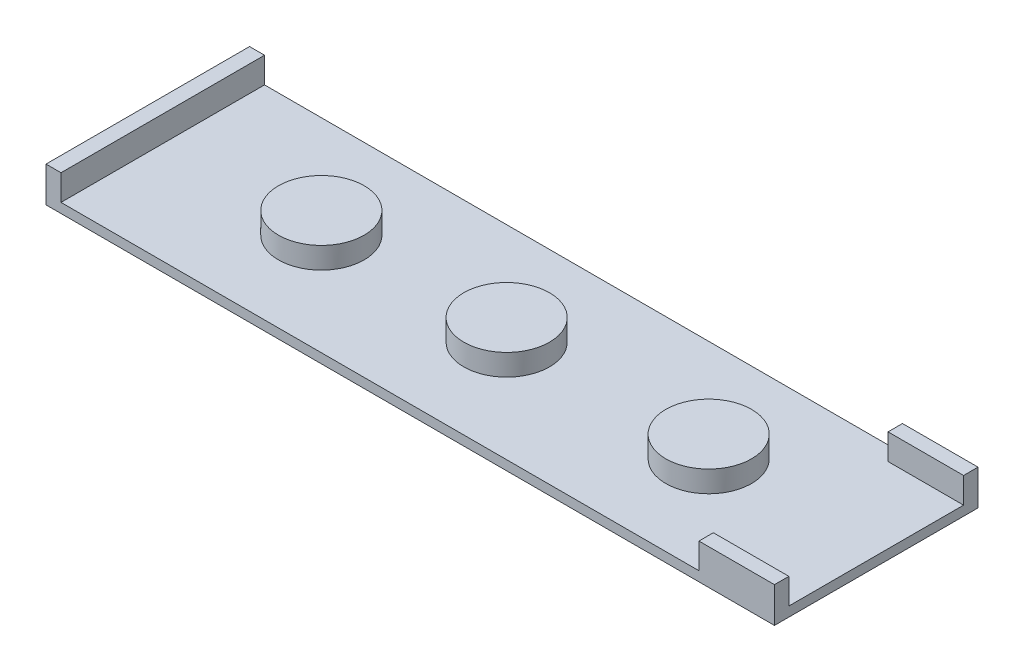
ISO-10303-21;
HEADER;
FILE_DESCRIPTION(('STEP AP214'),'2;1');
FILE_NAME('part.step','',(''),(''),'','','');
FILE_SCHEMA(('AUTOMOTIVE_DESIGN { 1 0 10303 214 1 1 1 1 }'));
ENDSEC;
DATA;
#1=APPLICATION_CONTEXT('core data for automotive mechanical design processes');
#2=APPLICATION_PROTOCOL_DEFINITION('international standard','automotive_design',2000,#1);
#3=PRODUCT_CONTEXT('',#1,'mechanical');
#4=PRODUCT('Part','Part','',(#3));
#5=PRODUCT_RELATED_PRODUCT_CATEGORY('part','',(#4));
#6=PRODUCT_DEFINITION_FORMATION('','',#4);
#7=PRODUCT_DEFINITION_CONTEXT('part definition',#1,'design');
#8=PRODUCT_DEFINITION('design','',#6,#7);
#9=PRODUCT_DEFINITION_SHAPE('','',#8);
#10=(LENGTH_UNIT() NAMED_UNIT(*) SI_UNIT(.MILLI.,.METRE.));
#11=(NAMED_UNIT(*) PLANE_ANGLE_UNIT() SI_UNIT($,.RADIAN.));
#12=(NAMED_UNIT(*) SI_UNIT($,.STERADIAN.) SOLID_ANGLE_UNIT());
#13=UNCERTAINTY_MEASURE_WITH_UNIT(LENGTH_MEASURE(1.E-05),#10,'distance_accuracy_value','');
#14=(GEOMETRIC_REPRESENTATION_CONTEXT(3) GLOBAL_UNCERTAINTY_ASSIGNED_CONTEXT((#13)) GLOBAL_UNIT_ASSIGNED_CONTEXT((#10,
#11,#12)) REPRESENTATION_CONTEXT('',''));
#15=CARTESIAN_POINT('',(0.,0.,0.));
#16=DIRECTION('',(0.,0.,1.));
#17=DIRECTION('',(1.,0.,0.));
#18=AXIS2_PLACEMENT_3D('',#15,#16,#17);
#19=CARTESIAN_POINT('',(0.,0.45,0.));
#20=DIRECTION('',(0.,-1.,0.));
#21=DIRECTION('',(0.,0.,-1.));
#22=AXIS2_PLACEMENT_3D('',#19,#20,#21);
#23=PLANE('',#22);
#24=CARTESIAN_POINT('',(14.3230348258706,0.45,1.01616915422886));
#25=DIRECTION('',(0.,-1.,0.));
#26=DIRECTION('',(0.,0.,-1.));
#27=AXIS2_PLACEMENT_3D('',#24,#25,#26);
#28=CIRCLE('',#27,2.);
#29=CARTESIAN_POINT('',(14.3230348258706,0.45,-0.983830845771148));
#30=VERTEX_POINT('',#29);
#31=EDGE_CURVE('E11',#30,#30,#28,.F.);
#32=ORIENTED_EDGE('',*,*,#31,.F.);
#33=EDGE_LOOP('',(#32));
#34=FACE_BOUND('',#33,.T.);
#35=CARTESIAN_POINT('',(4.89303482587064,0.45,1.01616915422886));
#36=DIRECTION('',(0.,-1.,0.));
#37=DIRECTION('',(0.,0.,-1.));
#38=AXIS2_PLACEMENT_3D('',#35,#36,#37);
#39=CIRCLE('',#38,2.);
#40=CARTESIAN_POINT('',(4.89303482587064,0.45,-0.983830845771145));
#41=VERTEX_POINT('',#40);
#42=EDGE_CURVE('E41',#41,#41,#39,.F.);
#43=ORIENTED_EDGE('',*,*,#42,.F.);
#44=EDGE_LOOP('',(#43));
#45=FACE_BOUND('',#44,.T.);
#46=CARTESIAN_POINT('',(-3.75696517412936,0.45,1.01616915422886));
#47=DIRECTION('',(0.,-1.,0.));
#48=DIRECTION('',(0.,0.,-1.));
#49=AXIS2_PLACEMENT_3D('',#46,#47,#48);
#50=CIRCLE('',#49,2.);
#51=CARTESIAN_POINT('',(-3.75696517412936,0.45,-0.983830845771145));
#52=VERTEX_POINT('',#51);
#53=EDGE_CURVE('E224',#52,#52,#50,.F.);
#54=ORIENTED_EDGE('',*,*,#53,.F.);
#55=EDGE_LOOP('',(#54));
#56=FACE_BOUND('',#55,.T.);
#57=DIRECTION('',(-1.,0.,0.));
#58=VECTOR('',#57,1.);
#59=CARTESIAN_POINT('',(22.1430348258706,0.45,5.09400851308146));
#60=LINE('',#59,#58);
#61=CARTESIAN_POINT('',(22.1430348258706,0.45,5.09400851308146));
#62=VERTEX_POINT('',#61);
#63=CARTESIAN_POINT('',(18.6182099532586,0.45,5.09400851308146));
#64=VERTEX_POINT('',#63);
#65=EDGE_CURVE('E236',#62,#64,#60,.T.);
#66=ORIENTED_EDGE('',*,*,#65,.F.);
#67=DIRECTION('',(0.,0.,-1.));
#68=VECTOR('',#67,1.);
#69=CARTESIAN_POINT('',(22.1430348258706,0.45,5.76616915422885));
#70=LINE('',#69,#68);
#71=CARTESIAN_POINT('',(22.1430348258706,0.45,-3.06038631168173));
#72=VERTEX_POINT('',#71);
#73=EDGE_CURVE('E143',#62,#72,#70,.T.);
#74=ORIENTED_EDGE('',*,*,#73,.T.);
#75=DIRECTION('',(1.,0.,0.));
#76=VECTOR('',#75,1.);
#77=CARTESIAN_POINT('',(22.1430348258706,0.45,-3.06038631168173));
#78=LINE('',#77,#76);
#79=CARTESIAN_POINT('',(18.6182099532586,0.45,-3.06038631168173));
#80=VERTEX_POINT('',#79);
#81=EDGE_CURVE('E147',#80,#72,#78,.T.);
#82=ORIENTED_EDGE('',*,*,#81,.F.);
#83=DIRECTION('',(0.,0.,1.));
#84=VECTOR('',#83,1.);
#85=CARTESIAN_POINT('',(18.6182099532586,0.45,-3.73383084577114));
#86=LINE('',#85,#84);
#87=CARTESIAN_POINT('',(18.6182099532586,0.45,-3.73383084577114));
#88=VERTEX_POINT('',#87);
#89=EDGE_CURVE('E144',#88,#80,#86,.T.);
#90=ORIENTED_EDGE('',*,*,#89,.F.);
#91=DIRECTION('',(-1.,0.,0.));
#92=VECTOR('',#91,1.);
#93=CARTESIAN_POINT('',(-11.8569651741294,0.45,-3.73383084577114));
#94=LINE('',#93,#92);
#95=CARTESIAN_POINT('',(-11.1569651741294,0.45,-3.73383084577114));
#96=VERTEX_POINT('',#95);
#97=EDGE_CURVE('E204',#88,#96,#94,.T.);
#98=ORIENTED_EDGE('',*,*,#97,.T.);
#99=DIRECTION('',(0.,0.,-1.));
#100=VECTOR('',#99,1.);
#101=CARTESIAN_POINT('',(-11.1569651741294,0.45,-3.73383084577114));
#102=LINE('',#101,#100);
#103=CARTESIAN_POINT('',(-11.1569651741294,0.45,5.76616915422886));
#104=VERTEX_POINT('',#103);
#105=EDGE_CURVE('E181',#104,#96,#102,.T.);
#106=ORIENTED_EDGE('',*,*,#105,.F.);
#107=DIRECTION('',(1.,0.,0.));
#108=VECTOR('',#107,1.);
#109=CARTESIAN_POINT('',(-11.8569651741294,0.45,5.76616915422886));
#110=LINE('',#109,#108);
#111=CARTESIAN_POINT('',(18.6182099532586,0.45,5.76616915422885));
#112=VERTEX_POINT('',#111);
#113=EDGE_CURVE('E53',#104,#112,#110,.T.);
#114=ORIENTED_EDGE('',*,*,#113,.T.);
#115=DIRECTION('',(0.,0.,1.));
#116=VECTOR('',#115,1.);
#117=CARTESIAN_POINT('',(18.6182099532586,0.45,5.76616915422885));
#118=LINE('',#117,#116);
#119=EDGE_CURVE('E48',#64,#112,#118,.T.);
#120=ORIENTED_EDGE('',*,*,#119,.F.);
#121=EDGE_LOOP('',(#66,#74,#82,#90,#98,#106,#114,#120));
#122=FACE_BOUND('',#121,.T.);
#123=ADVANCED_FACE('F33',(#34,#45,#56,#122),#23,.F.);
#124=CARTESIAN_POINT('',(-11.8569651741294,0.45,5.76616915422886));
#125=DIRECTION('',(1.,0.,0.));
#126=DIRECTION('',(0.,0.,-1.));
#127=AXIS2_PLACEMENT_3D('',#124,#125,#126);
#128=PLANE('',#127);
#129=DIRECTION('',(0.,0.,1.));
#130=VECTOR('',#129,1.);
#131=CARTESIAN_POINT('',(-11.8569651741294,0.,5.76616915422886));
#132=LINE('',#131,#130);
#133=CARTESIAN_POINT('',(-11.8569651741294,0.,-3.73383084577114));
#134=VERTEX_POINT('',#133);
#135=CARTESIAN_POINT('',(-11.8569651741294,0.,5.76616915422886));
#136=VERTEX_POINT('',#135);
#137=EDGE_CURVE('E200',#134,#136,#132,.T.);
#138=ORIENTED_EDGE('',*,*,#137,.T.);
#139=DIRECTION('',(0.,-1.,0.));
#140=VECTOR('',#139,1.);
#141=CARTESIAN_POINT('',(-11.8569651741294,0.45,5.76616915422886));
#142=LINE('',#141,#140);
#143=CARTESIAN_POINT('',(-11.8569651741294,1.65,5.76616915422886));
#144=VERTEX_POINT('',#143);
#145=EDGE_CURVE('E221',#144,#136,#142,.T.);
#146=ORIENTED_EDGE('',*,*,#145,.F.);
#147=DIRECTION('',(0.,0.,1.));
#148=VECTOR('',#147,1.);
#149=CARTESIAN_POINT('',(-11.8569651741294,1.65,-3.73383084577114));
#150=LINE('',#149,#148);
#151=CARTESIAN_POINT('',(-11.8569651741294,1.65,-3.73383084577114));
#152=VERTEX_POINT('',#151);
#153=EDGE_CURVE('E182',#152,#144,#150,.T.);
#154=ORIENTED_EDGE('',*,*,#153,.F.);
#155=DIRECTION('',(0.,-1.,0.));
#156=VECTOR('',#155,1.);
#157=CARTESIAN_POINT('',(-11.8569651741294,0.45,-3.73383084577114));
#158=LINE('',#157,#156);
#159=EDGE_CURVE('E206',#152,#134,#158,.T.);
#160=ORIENTED_EDGE('',*,*,#159,.T.);
#161=EDGE_LOOP('',(#138,#146,#154,#160));
#162=FACE_BOUND('',#161,.T.);
#163=ADVANCED_FACE('F35',(#162),#128,.F.);
#164=CARTESIAN_POINT('',(-11.8569651741294,0.45,5.76616915422886));
#165=DIRECTION('',(0.,0.,-1.));
#166=DIRECTION('',(-1.,0.,0.));
#167=AXIS2_PLACEMENT_3D('',#164,#165,#166);
#168=PLANE('',#167);
#169=DIRECTION('',(1.,0.,0.));
#170=VECTOR('',#169,1.);
#171=CARTESIAN_POINT('',(-11.8569651741294,0.,5.76616915422886));
#172=LINE('',#171,#170);
#173=CARTESIAN_POINT('',(22.1430348258706,0.,5.76616915422885));
#174=VERTEX_POINT('',#173);
#175=EDGE_CURVE('E209',#136,#174,#172,.T.);
#176=ORIENTED_EDGE('',*,*,#175,.T.);
#177=DIRECTION('',(0.,-1.,0.));
#178=VECTOR('',#177,1.);
#179=CARTESIAN_POINT('',(22.1430348258706,0.45,5.76616915422885));
#180=LINE('',#179,#178);
#181=CARTESIAN_POINT('',(22.1430348258706,1.65,5.76616915422885));
#182=VERTEX_POINT('',#181);
#183=EDGE_CURVE('E219',#182,#174,#180,.T.);
#184=ORIENTED_EDGE('',*,*,#183,.F.);
#185=DIRECTION('',(1.,0.,0.));
#186=VECTOR('',#185,1.);
#187=CARTESIAN_POINT('',(22.1430348258706,1.65,5.76616915422885));
#188=LINE('',#187,#186);
#189=CARTESIAN_POINT('',(18.6182099532586,1.65,5.76616915422885));
#190=VERTEX_POINT('',#189);
#191=EDGE_CURVE('E137',#190,#182,#188,.T.);
#192=ORIENTED_EDGE('',*,*,#191,.F.);
#193=DIRECTION('',(0.,-1.,0.));
#194=VECTOR('',#193,1.);
#195=CARTESIAN_POINT('',(18.6182099532586,1.65,5.76616915422885));
#196=LINE('',#195,#194);
#197=EDGE_CURVE('E149',#190,#112,#196,.T.);
#198=ORIENTED_EDGE('',*,*,#197,.T.);
#199=ORIENTED_EDGE('',*,*,#113,.F.);
#200=DIRECTION('',(0.,-1.,0.));
#201=VECTOR('',#200,1.);
#202=CARTESIAN_POINT('',(-11.1569651741294,1.65,5.76616915422886));
#203=LINE('',#202,#201);
#204=CARTESIAN_POINT('',(-11.1569651741294,1.65,5.76616915422886));
#205=VERTEX_POINT('',#204);
#206=EDGE_CURVE('E197',#205,#104,#203,.T.);
#207=ORIENTED_EDGE('',*,*,#206,.F.);
#208=DIRECTION('',(1.,0.,0.));
#209=VECTOR('',#208,1.);
#210=CARTESIAN_POINT('',(-11.8569651741294,1.65,5.76616915422886));
#211=LINE('',#210,#209);
#212=EDGE_CURVE('E185',#144,#205,#211,.T.);
#213=ORIENTED_EDGE('',*,*,#212,.F.);
#214=ORIENTED_EDGE('',*,*,#145,.T.);
#215=EDGE_LOOP('',(#176,#184,#192,#198,#199,#207,#213,#214));
#216=FACE_BOUND('',#215,.T.);
#217=ADVANCED_FACE('F246',(#216),#168,.F.);
#218=CARTESIAN_POINT('',(22.1430348258706,0.45,5.76616915422885));
#219=DIRECTION('',(-1.,0.,0.));
#220=DIRECTION('',(0.,0.,1.));
#221=AXIS2_PLACEMENT_3D('',#218,#219,#220);
#222=PLANE('',#221);
#223=DIRECTION('',(0.,0.,-1.));
#224=VECTOR('',#223,1.);
#225=CARTESIAN_POINT('',(22.1430348258706,0.,5.76616915422885));
#226=LINE('',#225,#224);
#227=CARTESIAN_POINT('',(22.1430348258706,0.,-3.73383084577114));
#228=VERTEX_POINT('',#227);
#229=EDGE_CURVE('E211',#174,#228,#226,.T.);
#230=ORIENTED_EDGE('',*,*,#229,.T.);
#231=DIRECTION('',(0.,-1.,0.));
#232=VECTOR('',#231,1.);
#233=CARTESIAN_POINT('',(22.1430348258706,0.45,-3.73383084577114));
#234=LINE('',#233,#232);
#235=CARTESIAN_POINT('',(22.1430348258706,1.65,-3.73383084577114));
#236=VERTEX_POINT('',#235);
#237=EDGE_CURVE('E216',#236,#228,#234,.T.);
#238=ORIENTED_EDGE('',*,*,#237,.F.);
#239=DIRECTION('',(0.,0.,-1.));
#240=VECTOR('',#239,1.);
#241=CARTESIAN_POINT('',(22.1430348258706,1.65,-3.73383084577114));
#242=LINE('',#241,#240);
#243=CARTESIAN_POINT('',(22.1430348258706,1.65,-3.06038631168173));
#244=VERTEX_POINT('',#243);
#245=EDGE_CURVE('E153',#244,#236,#242,.T.);
#246=ORIENTED_EDGE('',*,*,#245,.F.);
#247=DIRECTION('',(0.,-1.,0.));
#248=VECTOR('',#247,1.);
#249=CARTESIAN_POINT('',(22.1430348258706,1.65,-3.06038631168173));
#250=LINE('',#249,#248);
#251=EDGE_CURVE('E161',#244,#72,#250,.T.);
#252=ORIENTED_EDGE('',*,*,#251,.T.);
#253=ORIENTED_EDGE('',*,*,#73,.F.);
#254=DIRECTION('',(0.,-1.,0.));
#255=VECTOR('',#254,1.);
#256=CARTESIAN_POINT('',(22.1430348258706,1.65,5.09400851308146));
#257=LINE('',#256,#255);
#258=CARTESIAN_POINT('',(22.1430348258706,1.65,5.09400851308146));
#259=VERTEX_POINT('',#258);
#260=EDGE_CURVE('E125',#259,#62,#257,.T.);
#261=ORIENTED_EDGE('',*,*,#260,.F.);
#262=DIRECTION('',(0.,0.,-1.));
#263=VECTOR('',#262,1.);
#264=CARTESIAN_POINT('',(22.1430348258706,1.65,5.76616915422885));
#265=LINE('',#264,#263);
#266=EDGE_CURVE('E131',#182,#259,#265,.T.);
#267=ORIENTED_EDGE('',*,*,#266,.F.);
#268=ORIENTED_EDGE('',*,*,#183,.T.);
#269=EDGE_LOOP('',(#230,#238,#246,#252,#253,#261,#267,#268));
#270=FACE_BOUND('',#269,.T.);
#271=ADVANCED_FACE('F141',(#270),#222,.F.);
#272=CARTESIAN_POINT('',(-11.8569651741294,0.45,-3.73383084577114));
#273=DIRECTION('',(0.,0.,1.));
#274=DIRECTION('',(1.,0.,0.));
#275=AXIS2_PLACEMENT_3D('',#272,#273,#274);
#276=PLANE('',#275);
#277=DIRECTION('',(-1.,0.,0.));
#278=VECTOR('',#277,1.);
#279=CARTESIAN_POINT('',(-11.8569651741294,0.,-3.73383084577114));
#280=LINE('',#279,#278);
#281=EDGE_CURVE('E202',#228,#134,#280,.T.);
#282=ORIENTED_EDGE('',*,*,#281,.T.);
#283=ORIENTED_EDGE('',*,*,#159,.F.);
#284=DIRECTION('',(-1.,0.,0.));
#285=VECTOR('',#284,1.);
#286=CARTESIAN_POINT('',(-11.8569651741294,1.65,-3.73383084577114));
#287=LINE('',#286,#285);
#288=CARTESIAN_POINT('',(-11.1569651741294,1.65,-3.73383084577114));
#289=VERTEX_POINT('',#288);
#290=EDGE_CURVE('E189',#289,#152,#287,.T.);
#291=ORIENTED_EDGE('',*,*,#290,.F.);
#292=DIRECTION('',(0.,-1.,0.));
#293=VECTOR('',#292,1.);
#294=CARTESIAN_POINT('',(-11.1569651741294,1.65,-3.73383084577114));
#295=LINE('',#294,#293);
#296=EDGE_CURVE('E192',#289,#96,#295,.T.);
#297=ORIENTED_EDGE('',*,*,#296,.T.);
#298=ORIENTED_EDGE('',*,*,#97,.F.);
#299=DIRECTION('',(0.,-1.,0.));
#300=VECTOR('',#299,1.);
#301=CARTESIAN_POINT('',(18.6182099532586,1.65,-3.73383084577114));
#302=LINE('',#301,#300);
#303=CARTESIAN_POINT('',(18.6182099532586,1.65,-3.73383084577114));
#304=VERTEX_POINT('',#303);
#305=EDGE_CURVE('E169',#304,#88,#302,.T.);
#306=ORIENTED_EDGE('',*,*,#305,.F.);
#307=DIRECTION('',(-1.,0.,0.));
#308=VECTOR('',#307,1.);
#309=CARTESIAN_POINT('',(22.1430348258706,1.65,-3.73383084577114));
#310=LINE('',#309,#308);
#311=EDGE_CURVE('E156',#236,#304,#310,.T.);
#312=ORIENTED_EDGE('',*,*,#311,.F.);
#313=ORIENTED_EDGE('',*,*,#237,.T.);
#314=EDGE_LOOP('',(#282,#283,#291,#297,#298,#306,#312,#313));
#315=FACE_BOUND('',#314,.T.);
#316=ADVANCED_FACE('F253',(#315),#276,.F.);
#317=CARTESIAN_POINT('',(0.,0.,0.));
#318=DIRECTION('',(0.,-1.,0.));
#319=DIRECTION('',(0.,0.,-1.));
#320=AXIS2_PLACEMENT_3D('',#317,#318,#319);
#321=PLANE('',#320);
#322=ORIENTED_EDGE('',*,*,#137,.F.);
#323=ORIENTED_EDGE('',*,*,#281,.F.);
#324=ORIENTED_EDGE('',*,*,#229,.F.);
#325=ORIENTED_EDGE('',*,*,#175,.F.);
#326=EDGE_LOOP('',(#322,#323,#324,#325));
#327=FACE_BOUND('',#326,.T.);
#328=ADVANCED_FACE('F251',(#327),#321,.T.);
#329=CARTESIAN_POINT('',(-11.1569651741294,1.65,-3.73383084577114));
#330=DIRECTION('',(-1.,0.,0.));
#331=DIRECTION('',(0.,0.,1.));
#332=AXIS2_PLACEMENT_3D('',#329,#330,#331);
#333=PLANE('',#332);
#334=ORIENTED_EDGE('',*,*,#105,.T.);
#335=ORIENTED_EDGE('',*,*,#296,.F.);
#336=DIRECTION('',(0.,0.,-1.));
#337=VECTOR('',#336,1.);
#338=CARTESIAN_POINT('',(-11.1569651741294,1.65,-3.73383084577114));
#339=LINE('',#338,#337);
#340=EDGE_CURVE('E187',#205,#289,#339,.T.);
#341=ORIENTED_EDGE('',*,*,#340,.F.);
#342=ORIENTED_EDGE('',*,*,#206,.T.);
#343=EDGE_LOOP('',(#334,#335,#341,#342));
#344=FACE_BOUND('',#343,.T.);
#345=ADVANCED_FACE('F267',(#344),#333,.F.);
#346=CARTESIAN_POINT('',(0.,1.65,0.));
#347=DIRECTION('',(0.,1.,0.));
#348=DIRECTION('',(0.,0.,1.));
#349=AXIS2_PLACEMENT_3D('',#346,#347,#348);
#350=PLANE('',#349);
#351=ORIENTED_EDGE('',*,*,#153,.T.);
#352=ORIENTED_EDGE('',*,*,#212,.T.);
#353=ORIENTED_EDGE('',*,*,#340,.T.);
#354=ORIENTED_EDGE('',*,*,#290,.T.);
#355=EDGE_LOOP('',(#351,#352,#353,#354));
#356=FACE_BOUND('',#355,.T.);
#357=ADVANCED_FACE('F260',(#356),#350,.T.);
#358=CARTESIAN_POINT('',(-3.75696517412936,1.45,1.01616915422886));
#359=DIRECTION('',(0.,-1.,0.));
#360=DIRECTION('',(0.,0.,-1.));
#361=AXIS2_PLACEMENT_3D('',#358,#359,#360);
#362=CYLINDRICAL_SURFACE('',#361,2.);
#363=CARTESIAN_POINT('',(-3.75696517412936,1.45,1.01616915422886));
#364=DIRECTION('',(0.,1.,0.));
#365=DIRECTION('',(0.,0.,1.));
#366=AXIS2_PLACEMENT_3D('',#363,#364,#365);
#367=CIRCLE('',#366,2.);
#368=CARTESIAN_POINT('',(-3.75696517412936,1.45,3.01616915422886));
#369=VERTEX_POINT('',#368);
#370=EDGE_CURVE('E178',#369,#369,#367,.T.);
#371=ORIENTED_EDGE('',*,*,#370,.F.);
#372=EDGE_LOOP('',(#371));
#373=FACE_BOUND('',#372,.T.);
#374=ORIENTED_EDGE('',*,*,#53,.T.);
#375=EDGE_LOOP('',(#374));
#376=FACE_BOUND('',#375,.T.);
#377=ADVANCED_FACE('F307',(#373,#376),#362,.T.);
#378=CARTESIAN_POINT('',(-3.75696517412936,1.45,1.01616915422886));
#379=DIRECTION('',(0.,1.,0.));
#380=DIRECTION('',(0.,0.,1.));
#381=AXIS2_PLACEMENT_3D('',#378,#379,#380);
#382=PLANE('',#381);
#383=ORIENTED_EDGE('',*,*,#370,.T.);
#384=EDGE_LOOP('',(#383));
#385=FACE_BOUND('',#384,.T.);
#386=ADVANCED_FACE('F303',(#385),#382,.T.);
#387=CARTESIAN_POINT('',(4.89303482587064,1.45,1.01616915422886));
#388=DIRECTION('',(0.,-1.,0.));
#389=DIRECTION('',(0.,0.,-1.));
#390=AXIS2_PLACEMENT_3D('',#387,#388,#389);
#391=CYLINDRICAL_SURFACE('',#390,2.);
#392=CARTESIAN_POINT('',(4.89303482587064,1.45,1.01616915422886));
#393=DIRECTION('',(0.,1.,0.));
#394=DIRECTION('',(0.,0.,1.));
#395=AXIS2_PLACEMENT_3D('',#392,#393,#394);
#396=CIRCLE('',#395,2.);
#397=CARTESIAN_POINT('',(4.89303482587064,1.45,3.01616915422886));
#398=VERTEX_POINT('',#397);
#399=EDGE_CURVE('E175',#398,#398,#396,.T.);
#400=ORIENTED_EDGE('',*,*,#399,.F.);
#401=EDGE_LOOP('',(#400));
#402=FACE_BOUND('',#401,.T.);
#403=ORIENTED_EDGE('',*,*,#42,.T.);
#404=EDGE_LOOP('',(#403));
#405=FACE_BOUND('',#404,.T.);
#406=ADVANCED_FACE('F229',(#402,#405),#391,.T.);
#407=CARTESIAN_POINT('',(4.89303482587064,1.45,1.01616915422886));
#408=DIRECTION('',(0.,1.,0.));
#409=DIRECTION('',(0.,0.,1.));
#410=AXIS2_PLACEMENT_3D('',#407,#408,#409);
#411=PLANE('',#410);
#412=ORIENTED_EDGE('',*,*,#399,.T.);
#413=EDGE_LOOP('',(#412));
#414=FACE_BOUND('',#413,.T.);
#415=ADVANCED_FACE('F296',(#414),#411,.T.);
#416=CARTESIAN_POINT('',(14.3230348258706,1.45,1.01616915422886));
#417=DIRECTION('',(0.,-1.,0.));
#418=DIRECTION('',(0.,0.,-1.));
#419=AXIS2_PLACEMENT_3D('',#416,#417,#418);
#420=CYLINDRICAL_SURFACE('',#419,2.);
#421=CARTESIAN_POINT('',(14.3230348258706,1.45,1.01616915422886));
#422=DIRECTION('',(0.,1.,0.));
#423=DIRECTION('',(0.,0.,1.));
#424=AXIS2_PLACEMENT_3D('',#421,#422,#423);
#425=CIRCLE('',#424,2.);
#426=CARTESIAN_POINT('',(14.3230348258706,1.45,3.01616915422886));
#427=VERTEX_POINT('',#426);
#428=EDGE_CURVE('E172',#427,#427,#425,.T.);
#429=ORIENTED_EDGE('',*,*,#428,.F.);
#430=EDGE_LOOP('',(#429));
#431=FACE_BOUND('',#430,.T.);
#432=ORIENTED_EDGE('',*,*,#31,.T.);
#433=EDGE_LOOP('',(#432));
#434=FACE_BOUND('',#433,.T.);
#435=ADVANCED_FACE('F292',(#431,#434),#420,.T.);
#436=CARTESIAN_POINT('',(14.3230348258706,1.45,1.01616915422886));
#437=DIRECTION('',(0.,1.,0.));
#438=DIRECTION('',(0.,0.,1.));
#439=AXIS2_PLACEMENT_3D('',#436,#437,#438);
#440=PLANE('',#439);
#441=ORIENTED_EDGE('',*,*,#428,.T.);
#442=EDGE_LOOP('',(#441));
#443=FACE_BOUND('',#442,.T.);
#444=ADVANCED_FACE('F286',(#443),#440,.T.);
#445=CARTESIAN_POINT('',(18.6182099532586,1.65,-3.73383084577114));
#446=DIRECTION('',(1.,0.,0.));
#447=DIRECTION('',(0.,0.,-1.));
#448=AXIS2_PLACEMENT_3D('',#445,#446,#447);
#449=PLANE('',#448);
#450=ORIENTED_EDGE('',*,*,#89,.T.);
#451=DIRECTION('',(0.,-1.,0.));
#452=VECTOR('',#451,1.);
#453=CARTESIAN_POINT('',(18.6182099532586,1.65,-3.06038631168173));
#454=LINE('',#453,#452);
#455=CARTESIAN_POINT('',(18.6182099532586,1.65,-3.06038631168173));
#456=VERTEX_POINT('',#455);
#457=EDGE_CURVE('E166',#456,#80,#454,.T.);
#458=ORIENTED_EDGE('',*,*,#457,.F.);
#459=DIRECTION('',(0.,0.,1.));
#460=VECTOR('',#459,1.);
#461=CARTESIAN_POINT('',(18.6182099532586,1.65,-3.73383084577114));
#462=LINE('',#461,#460);
#463=EDGE_CURVE('E158',#304,#456,#462,.T.);
#464=ORIENTED_EDGE('',*,*,#463,.F.);
#465=ORIENTED_EDGE('',*,*,#305,.T.);
#466=EDGE_LOOP('',(#450,#458,#464,#465));
#467=FACE_BOUND('',#466,.T.);
#468=ADVANCED_FACE('F271',(#467),#449,.F.);
#469=CARTESIAN_POINT('',(22.1430348258706,1.65,-3.06038631168173));
#470=DIRECTION('',(0.,0.,-1.));
#471=DIRECTION('',(-1.,0.,0.));
#472=AXIS2_PLACEMENT_3D('',#469,#470,#471);
#473=PLANE('',#472);
#474=ORIENTED_EDGE('',*,*,#81,.T.);
#475=ORIENTED_EDGE('',*,*,#251,.F.);
#476=DIRECTION('',(1.,0.,0.));
#477=VECTOR('',#476,1.);
#478=CARTESIAN_POINT('',(22.1430348258706,1.65,-3.06038631168173));
#479=LINE('',#478,#477);
#480=EDGE_CURVE('E160',#456,#244,#479,.T.);
#481=ORIENTED_EDGE('',*,*,#480,.F.);
#482=ORIENTED_EDGE('',*,*,#457,.T.);
#483=EDGE_LOOP('',(#474,#475,#481,#482));
#484=FACE_BOUND('',#483,.T.);
#485=ADVANCED_FACE('F278',(#484),#473,.F.);
#486=CARTESIAN_POINT('',(0.,1.65,0.));
#487=DIRECTION('',(0.,-1.,0.));
#488=DIRECTION('',(0.,0.,-1.));
#489=AXIS2_PLACEMENT_3D('',#486,#487,#488);
#490=PLANE('',#489);
#491=ORIENTED_EDGE('',*,*,#245,.T.);
#492=ORIENTED_EDGE('',*,*,#311,.T.);
#493=ORIENTED_EDGE('',*,*,#463,.T.);
#494=ORIENTED_EDGE('',*,*,#480,.T.);
#495=EDGE_LOOP('',(#491,#492,#493,#494));
#496=FACE_BOUND('',#495,.T.);
#497=ADVANCED_FACE('F274',(#496),#490,.F.);
#498=CARTESIAN_POINT('',(22.1430348258706,1.65,5.09400851308146));
#499=DIRECTION('',(0.,0.,1.));
#500=DIRECTION('',(1.,0.,0.));
#501=AXIS2_PLACEMENT_3D('',#498,#499,#500);
#502=PLANE('',#501);
#503=ORIENTED_EDGE('',*,*,#65,.T.);
#504=DIRECTION('',(0.,-1.,0.));
#505=VECTOR('',#504,1.);
#506=CARTESIAN_POINT('',(18.6182099532586,1.65,5.09400851308146));
#507=LINE('',#506,#505);
#508=CARTESIAN_POINT('',(18.6182099532586,1.65,5.09400851308146));
#509=VERTEX_POINT('',#508);
#510=EDGE_CURVE('E127',#509,#64,#507,.T.);
#511=ORIENTED_EDGE('',*,*,#510,.F.);
#512=DIRECTION('',(-1.,0.,0.));
#513=VECTOR('',#512,1.);
#514=CARTESIAN_POINT('',(22.1430348258706,1.65,5.09400851308146));
#515=LINE('',#514,#513);
#516=EDGE_CURVE('E121',#259,#509,#515,.T.);
#517=ORIENTED_EDGE('',*,*,#516,.F.);
#518=ORIENTED_EDGE('',*,*,#260,.T.);
#519=EDGE_LOOP('',(#503,#511,#517,#518));
#520=FACE_BOUND('',#519,.T.);
#521=ADVANCED_FACE('F123',(#520),#502,.F.);
#522=CARTESIAN_POINT('',(18.6182099532586,1.65,5.76616915422885));
#523=DIRECTION('',(1.,0.,0.));
#524=DIRECTION('',(0.,0.,-1.));
#525=AXIS2_PLACEMENT_3D('',#522,#523,#524);
#526=PLANE('',#525);
#527=ORIENTED_EDGE('',*,*,#119,.T.);
#528=ORIENTED_EDGE('',*,*,#197,.F.);
#529=DIRECTION('',(0.,0.,1.));
#530=VECTOR('',#529,1.);
#531=CARTESIAN_POINT('',(18.6182099532586,1.65,5.76616915422885));
#532=LINE('',#531,#530);
#533=EDGE_CURVE('E130',#509,#190,#532,.T.);
#534=ORIENTED_EDGE('',*,*,#533,.F.);
#535=ORIENTED_EDGE('',*,*,#510,.T.);
#536=EDGE_LOOP('',(#527,#528,#534,#535));
#537=FACE_BOUND('',#536,.T.);
#538=ADVANCED_FACE('F245',(#537),#526,.F.);
#539=CARTESIAN_POINT('',(0.,1.65,0.));
#540=DIRECTION('',(0.,1.,0.));
#541=DIRECTION('',(0.,0.,1.));
#542=AXIS2_PLACEMENT_3D('',#539,#540,#541);
#543=PLANE('',#542);
#544=ORIENTED_EDGE('',*,*,#266,.T.);
#545=ORIENTED_EDGE('',*,*,#516,.T.);
#546=ORIENTED_EDGE('',*,*,#533,.T.);
#547=ORIENTED_EDGE('',*,*,#191,.T.);
#548=EDGE_LOOP('',(#544,#545,#546,#547));
#549=FACE_BOUND('',#548,.T.);
#550=ADVANCED_FACE('F135',(#549),#543,.T.);
#551=CLOSED_SHELL('',(#123,#163,#217,#271,#316,#328,#345,#357,#377,#386,#406,#415,#435,#444,
#468,#485,#497,#521,#538,#550));
#552=MANIFOLD_SOLID_BREP('B2',#551);
#553=ADVANCED_BREP_SHAPE_REPRESENTATION('',(#18,#552),#14);
#554=SHAPE_DEFINITION_REPRESENTATION(#9,#553);
ENDSEC;
END-ISO-10303-21;
